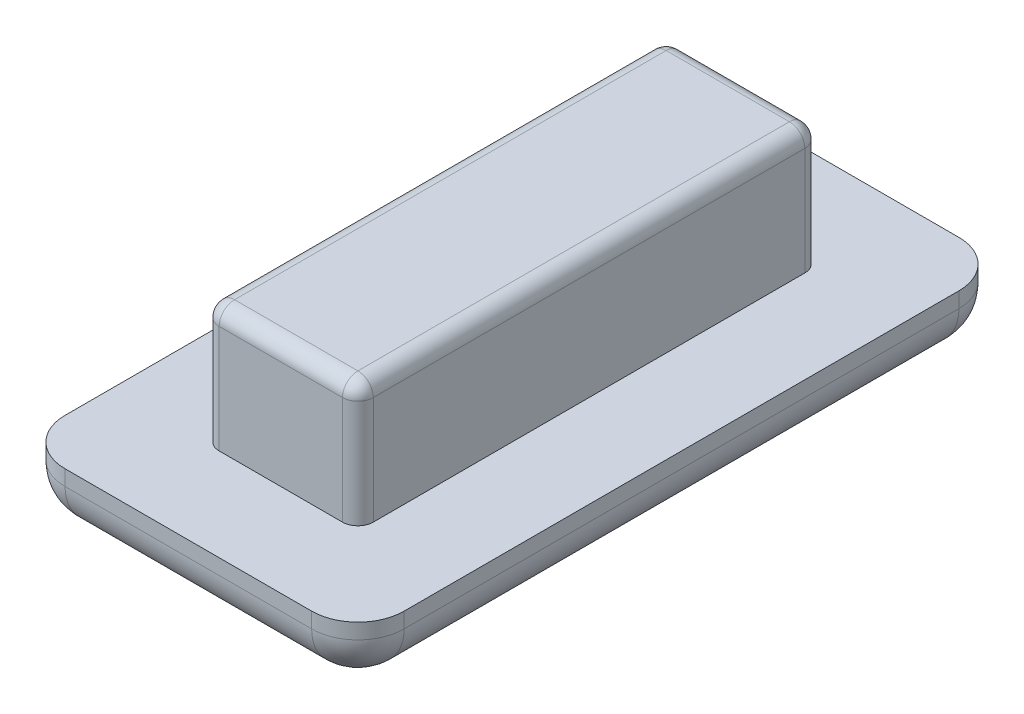
ISO-10303-21;
HEADER;
FILE_DESCRIPTION(('STEP AP214'),'2;1');
FILE_NAME('part.step','',(''),(''),'','','');
FILE_SCHEMA(('AUTOMOTIVE_DESIGN { 1 0 10303 214 1 1 1 1 }'));
ENDSEC;
DATA;
#1=APPLICATION_CONTEXT('core data for automotive mechanical design processes');
#2=APPLICATION_PROTOCOL_DEFINITION('international standard','automotive_design',2000,#1);
#3=PRODUCT_CONTEXT('',#1,'mechanical');
#4=PRODUCT('Part','Part','',(#3));
#5=PRODUCT_RELATED_PRODUCT_CATEGORY('part','',(#4));
#6=PRODUCT_DEFINITION_FORMATION('','',#4);
#7=PRODUCT_DEFINITION_CONTEXT('part definition',#1,'design');
#8=PRODUCT_DEFINITION('design','',#6,#7);
#9=PRODUCT_DEFINITION_SHAPE('','',#8);
#10=(LENGTH_UNIT() NAMED_UNIT(*) SI_UNIT(.MILLI.,.METRE.));
#11=(NAMED_UNIT(*) PLANE_ANGLE_UNIT() SI_UNIT($,.RADIAN.));
#12=(NAMED_UNIT(*) SI_UNIT($,.STERADIAN.) SOLID_ANGLE_UNIT());
#13=UNCERTAINTY_MEASURE_WITH_UNIT(LENGTH_MEASURE(1.E-05),#10,'distance_accuracy_value','');
#14=(GEOMETRIC_REPRESENTATION_CONTEXT(3) GLOBAL_UNCERTAINTY_ASSIGNED_CONTEXT((#13)) GLOBAL_UNIT_ASSIGNED_CONTEXT((#10,
#11,#12)) REPRESENTATION_CONTEXT('',''));
#15=CARTESIAN_POINT('',(0.,0.,0.));
#16=DIRECTION('',(0.,0.,1.));
#17=DIRECTION('',(1.,0.,0.));
#18=AXIS2_PLACEMENT_3D('',#15,#16,#17);
#19=CARTESIAN_POINT('',(0.500000000000003,4.,-0.499999999999978));
#20=DIRECTION('',(1.,0.,0.));
#21=DIRECTION('',(0.,0.,-1.));
#22=AXIS2_PLACEMENT_3D('',#19,#20,#21);
#23=PLANE('',#22);
#24=DIRECTION('',(0.,0.,1.));
#25=VECTOR('',#24,1.);
#26=CARTESIAN_POINT('',(0.500000000000003,3.5,-15.5));
#27=LINE('',#26,#25);
#28=CARTESIAN_POINT('',(0.500000000000003,3.5,-0.999999999999978));
#29=VERTEX_POINT('',#28);
#30=CARTESIAN_POINT('',(0.500000000000003,3.5,-15.));
#31=VERTEX_POINT('',#30);
#32=EDGE_CURVE('E230',#29,#31,#27,.F.);
#33=ORIENTED_EDGE('',*,*,#32,.T.);
#34=DIRECTION('',(0.,-1.,0.));
#35=VECTOR('',#34,1.);
#36=CARTESIAN_POINT('',(0.500000000000003,4.,-15.));
#37=LINE('',#36,#35);
#38=CARTESIAN_POINT('',(0.500000000000003,0.,-15.));
#39=VERTEX_POINT('',#38);
#40=EDGE_CURVE('E232',#31,#39,#37,.T.);
#41=ORIENTED_EDGE('',*,*,#40,.T.);
#42=DIRECTION('',(0.,0.,1.));
#43=VECTOR('',#42,1.);
#44=CARTESIAN_POINT('',(0.500000000000003,0.,-0.499999999999978));
#45=LINE('',#44,#43);
#46=CARTESIAN_POINT('',(0.500000000000003,0.,-0.999999999999978));
#47=VERTEX_POINT('',#46);
#48=EDGE_CURVE('E382',#39,#47,#45,.T.);
#49=ORIENTED_EDGE('',*,*,#48,.T.);
#50=DIRECTION('',(0.,-1.,0.));
#51=VECTOR('',#50,1.);
#52=CARTESIAN_POINT('',(0.500000000000003,4.,-0.999999999999978));
#53=LINE('',#52,#51);
#54=EDGE_CURVE('E228',#47,#29,#53,.F.);
#55=ORIENTED_EDGE('',*,*,#54,.T.);
#56=EDGE_LOOP('',(#33,#41,#49,#55));
#57=FACE_BOUND('',#56,.T.);
#58=ADVANCED_FACE('F33',(#57),#23,.F.);
#59=CARTESIAN_POINT('',(5.50000000000001,4.,-0.499999999999978));
#60=DIRECTION('',(0.,0.,-1.));
#61=DIRECTION('',(-1.,0.,0.));
#62=AXIS2_PLACEMENT_3D('',#59,#60,#61);
#63=PLANE('',#62);
#64=DIRECTION('',(1.,0.,0.));
#65=VECTOR('',#64,1.);
#66=CARTESIAN_POINT('',(0.500000000000003,3.5,-0.499999999999978));
#67=LINE('',#66,#65);
#68=CARTESIAN_POINT('',(5.00000000000001,3.5,-0.499999999999978));
#69=VERTEX_POINT('',#68);
#70=CARTESIAN_POINT('',(1.,3.5,-0.499999999999978));
#71=VERTEX_POINT('',#70);
#72=EDGE_CURVE('E224',#69,#71,#67,.F.);
#73=ORIENTED_EDGE('',*,*,#72,.T.);
#74=DIRECTION('',(0.,-1.,0.));
#75=VECTOR('',#74,1.);
#76=CARTESIAN_POINT('',(1.,4.,-0.499999999999978));
#77=LINE('',#76,#75);
#78=CARTESIAN_POINT('',(1.,0.,-0.499999999999978));
#79=VERTEX_POINT('',#78);
#80=EDGE_CURVE('E226',#71,#79,#77,.T.);
#81=ORIENTED_EDGE('',*,*,#80,.T.);
#82=DIRECTION('',(1.,0.,0.));
#83=VECTOR('',#82,1.);
#84=CARTESIAN_POINT('',(5.50000000000001,0.,-0.499999999999978));
#85=LINE('',#84,#83);
#86=CARTESIAN_POINT('',(5.00000000000001,0.,-0.499999999999978));
#87=VERTEX_POINT('',#86);
#88=EDGE_CURVE('E385',#79,#87,#85,.T.);
#89=ORIENTED_EDGE('',*,*,#88,.T.);
#90=DIRECTION('',(0.,-1.,0.));
#91=VECTOR('',#90,1.);
#92=CARTESIAN_POINT('',(5.00000000000001,4.,-0.499999999999978));
#93=LINE('',#92,#91);
#94=EDGE_CURVE('E222',#87,#69,#93,.F.);
#95=ORIENTED_EDGE('',*,*,#94,.T.);
#96=EDGE_LOOP('',(#73,#81,#89,#95));
#97=FACE_BOUND('',#96,.T.);
#98=ADVANCED_FACE('F442',(#97),#63,.F.);
#99=CARTESIAN_POINT('',(5.50000000000001,4.,-0.499999999999978));
#100=DIRECTION('',(-1.,0.,0.));
#101=DIRECTION('',(0.,0.,1.));
#102=AXIS2_PLACEMENT_3D('',#99,#100,#101);
#103=PLANE('',#102);
#104=DIRECTION('',(0.,0.,-1.));
#105=VECTOR('',#104,1.);
#106=CARTESIAN_POINT('',(5.50000000000001,0.,-0.499999999999978));
#107=LINE('',#106,#105);
#108=CARTESIAN_POINT('',(5.50000000000001,0.,-0.999999999999978));
#109=VERTEX_POINT('',#108);
#110=CARTESIAN_POINT('',(5.50000000000001,0.,-15.));
#111=VERTEX_POINT('',#110);
#112=EDGE_CURVE('E388',#109,#111,#107,.T.);
#113=ORIENTED_EDGE('',*,*,#112,.T.);
#114=DIRECTION('',(0.,-1.,0.));
#115=VECTOR('',#114,1.);
#116=CARTESIAN_POINT('',(5.50000000000001,4.,-15.));
#117=LINE('',#116,#115);
#118=CARTESIAN_POINT('',(5.50000000000001,3.5,-15.));
#119=VERTEX_POINT('',#118);
#120=EDGE_CURVE('E220',#111,#119,#117,.F.);
#121=ORIENTED_EDGE('',*,*,#120,.T.);
#122=DIRECTION('',(0.,0.,-1.));
#123=VECTOR('',#122,1.);
#124=CARTESIAN_POINT('',(5.50000000000001,3.5,-0.499999999999978));
#125=LINE('',#124,#123);
#126=CARTESIAN_POINT('',(5.50000000000001,3.5,-0.999999999999978));
#127=VERTEX_POINT('',#126);
#128=EDGE_CURVE('E218',#119,#127,#125,.F.);
#129=ORIENTED_EDGE('',*,*,#128,.T.);
#130=DIRECTION('',(0.,-1.,0.));
#131=VECTOR('',#130,1.);
#132=CARTESIAN_POINT('',(5.50000000000001,4.,-0.999999999999978));
#133=LINE('',#132,#131);
#134=EDGE_CURVE('E216',#127,#109,#133,.T.);
#135=ORIENTED_EDGE('',*,*,#134,.T.);
#136=EDGE_LOOP('',(#113,#121,#129,#135));
#137=FACE_BOUND('',#136,.T.);
#138=ADVANCED_FACE('F447',(#137),#103,.F.);
#139=CARTESIAN_POINT('',(5.50000000000001,4.,-15.5));
#140=DIRECTION('',(0.,0.,1.));
#141=DIRECTION('',(1.,0.,0.));
#142=AXIS2_PLACEMENT_3D('',#139,#140,#141);
#143=PLANE('',#142);
#144=DIRECTION('',(-1.,0.,0.));
#145=VECTOR('',#144,1.);
#146=CARTESIAN_POINT('',(5.50000000000001,0.,-15.5));
#147=LINE('',#146,#145);
#148=CARTESIAN_POINT('',(5.00000000000001,0.,-15.5));
#149=VERTEX_POINT('',#148);
#150=CARTESIAN_POINT('',(1.,0.,-15.5));
#151=VERTEX_POINT('',#150);
#152=EDGE_CURVE('E201',#149,#151,#147,.T.);
#153=ORIENTED_EDGE('',*,*,#152,.T.);
#154=DIRECTION('',(0.,-1.,0.));
#155=VECTOR('',#154,1.);
#156=CARTESIAN_POINT('',(1.,4.,-15.5));
#157=LINE('',#156,#155);
#158=CARTESIAN_POINT('',(1.,3.5,-15.5));
#159=VERTEX_POINT('',#158);
#160=EDGE_CURVE('E214',#151,#159,#157,.F.);
#161=ORIENTED_EDGE('',*,*,#160,.T.);
#162=DIRECTION('',(-1.,0.,0.));
#163=VECTOR('',#162,1.);
#164=CARTESIAN_POINT('',(5.50000000000001,3.5,-15.5));
#165=LINE('',#164,#163);
#166=CARTESIAN_POINT('',(5.00000000000001,3.5,-15.5));
#167=VERTEX_POINT('',#166);
#168=EDGE_CURVE('E178',#159,#167,#165,.F.);
#169=ORIENTED_EDGE('',*,*,#168,.T.);
#170=DIRECTION('',(0.,-1.,0.));
#171=VECTOR('',#170,1.);
#172=CARTESIAN_POINT('',(5.00000000000001,4.,-15.5));
#173=LINE('',#172,#171);
#174=EDGE_CURVE('E207',#167,#149,#173,.T.);
#175=ORIENTED_EDGE('',*,*,#174,.T.);
#176=EDGE_LOOP('',(#153,#161,#169,#175));
#177=FACE_BOUND('',#176,.T.);
#178=ADVANCED_FACE('F415',(#177),#143,.F.);
#179=CARTESIAN_POINT('',(0.,4.,0.));
#180=DIRECTION('',(0.,1.,0.));
#181=DIRECTION('',(0.,0.,1.));
#182=AXIS2_PLACEMENT_3D('',#179,#180,#181);
#183=PLANE('',#182);
#184=DIRECTION('',(0.,0.,-1.));
#185=VECTOR('',#184,1.);
#186=CARTESIAN_POINT('',(5.00000000000001,4.,-15.5));
#187=LINE('',#186,#185);
#188=CARTESIAN_POINT('',(5.00000000000001,4.,-0.999999999999978));
#189=VERTEX_POINT('',#188);
#190=CARTESIAN_POINT('',(5.00000000000001,4.,-15.));
#191=VERTEX_POINT('',#190);
#192=EDGE_CURVE('E205',#189,#191,#187,.T.);
#193=ORIENTED_EDGE('',*,*,#192,.T.);
#194=DIRECTION('',(-1.,0.,0.));
#195=VECTOR('',#194,1.);
#196=CARTESIAN_POINT('',(0.500000000000003,4.,-15.));
#197=LINE('',#196,#195);
#198=CARTESIAN_POINT('',(1.,4.,-15.));
#199=VERTEX_POINT('',#198);
#200=EDGE_CURVE('E176',#191,#199,#197,.T.);
#201=ORIENTED_EDGE('',*,*,#200,.T.);
#202=DIRECTION('',(0.,0.,1.));
#203=VECTOR('',#202,1.);
#204=CARTESIAN_POINT('',(1.,4.,-0.499999999999978));
#205=LINE('',#204,#203);
#206=CARTESIAN_POINT('',(1.,4.,-0.999999999999978));
#207=VERTEX_POINT('',#206);
#208=EDGE_CURVE('E194',#199,#207,#205,.T.);
#209=ORIENTED_EDGE('',*,*,#208,.T.);
#210=DIRECTION('',(1.,0.,0.));
#211=VECTOR('',#210,1.);
#212=CARTESIAN_POINT('',(5.50000000000001,4.,-0.999999999999978));
#213=LINE('',#212,#211);
#214=EDGE_CURVE('E200',#207,#189,#213,.T.);
#215=ORIENTED_EDGE('',*,*,#214,.T.);
#216=EDGE_LOOP('',(#193,#201,#209,#215));
#217=FACE_BOUND('',#216,.T.);
#218=ADVANCED_FACE('F203',(#217),#183,.T.);
#219=CARTESIAN_POINT('',(8.50000000000001,-2.,2.50000000000002));
#220=DIRECTION('',(-1.,0.,0.));
#221=DIRECTION('',(0.,0.,1.));
#222=AXIS2_PLACEMENT_3D('',#219,#220,#221);
#223=PLANE('',#222);
#224=DIRECTION('',(0.,0.,1.));
#225=VECTOR('',#224,1.);
#226=CARTESIAN_POINT('',(8.50000000000001,-0.5,-18.5));
#227=LINE('',#226,#225);
#228=CARTESIAN_POINT('',(8.50000000000001,-0.5,1.00000000000002));
#229=VERTEX_POINT('',#228);
#230=CARTESIAN_POINT('',(8.50000000000001,-0.5,-17.));
#231=VERTEX_POINT('',#230);
#232=EDGE_CURVE('E50',#229,#231,#227,.F.);
#233=ORIENTED_EDGE('',*,*,#232,.T.);
#234=DIRECTION('',(0.,1.,0.));
#235=VECTOR('',#234,1.);
#236=CARTESIAN_POINT('',(8.50000000000001,-2.,-17.));
#237=LINE('',#236,#235);
#238=CARTESIAN_POINT('',(8.50000000000001,0.,-17.));
#239=VERTEX_POINT('',#238);
#240=EDGE_CURVE('E296',#231,#239,#237,.T.);
#241=ORIENTED_EDGE('',*,*,#240,.T.);
#242=DIRECTION('',(0.,0.,1.));
#243=VECTOR('',#242,1.);
#244=CARTESIAN_POINT('',(8.50000000000001,0.,2.50000000000002));
#245=LINE('',#244,#243);
#246=CARTESIAN_POINT('',(8.50000000000001,0.,1.00000000000002));
#247=VERTEX_POINT('',#246);
#248=EDGE_CURVE('E266',#239,#247,#245,.T.);
#249=ORIENTED_EDGE('',*,*,#248,.T.);
#250=DIRECTION('',(0.,1.,0.));
#251=VECTOR('',#250,1.);
#252=CARTESIAN_POINT('',(8.50000000000001,-2.,1.00000000000002));
#253=LINE('',#252,#251);
#254=EDGE_CURVE('E55',#247,#229,#253,.F.);
#255=ORIENTED_EDGE('',*,*,#254,.T.);
#256=EDGE_LOOP('',(#233,#241,#249,#255));
#257=FACE_BOUND('',#256,.T.);
#258=ADVANCED_FACE('F372',(#257),#223,.F.);
#259=CARTESIAN_POINT('',(-2.5,-2.,2.50000000000002));
#260=DIRECTION('',(0.,0.,-1.));
#261=DIRECTION('',(-1.,0.,0.));
#262=AXIS2_PLACEMENT_3D('',#259,#260,#261);
#263=PLANE('',#262);
#264=DIRECTION('',(-1.,0.,0.));
#265=VECTOR('',#264,1.);
#266=CARTESIAN_POINT('',(-2.5,0.,2.50000000000002));
#267=LINE('',#266,#265);
#268=CARTESIAN_POINT('',(7.00000000000001,0.,2.50000000000002));
#269=VERTEX_POINT('',#268);
#270=CARTESIAN_POINT('',(-0.999999999999996,0.,2.50000000000002));
#271=VERTEX_POINT('',#270);
#272=EDGE_CURVE('E371',#269,#271,#267,.T.);
#273=ORIENTED_EDGE('',*,*,#272,.T.);
#274=DIRECTION('',(0.,1.,0.));
#275=VECTOR('',#274,1.);
#276=CARTESIAN_POINT('',(-0.999999999999996,-2.,2.50000000000002));
#277=LINE('',#276,#275);
#278=CARTESIAN_POINT('',(-0.999999999999996,-0.5,2.50000000000002));
#279=VERTEX_POINT('',#278);
#280=EDGE_CURVE('E292',#271,#279,#277,.F.);
#281=ORIENTED_EDGE('',*,*,#280,.T.);
#282=DIRECTION('',(-1.,0.,0.));
#283=VECTOR('',#282,1.);
#284=CARTESIAN_POINT('',(8.50000000000001,-0.5,2.50000000000002));
#285=LINE('',#284,#283);
#286=CARTESIAN_POINT('',(7.00000000000001,-0.5,2.50000000000002));
#287=VERTEX_POINT('',#286);
#288=EDGE_CURVE('E290',#279,#287,#285,.F.);
#289=ORIENTED_EDGE('',*,*,#288,.T.);
#290=DIRECTION('',(0.,1.,0.));
#291=VECTOR('',#290,1.);
#292=CARTESIAN_POINT('',(7.00000000000001,-2.,2.50000000000002));
#293=LINE('',#292,#291);
#294=EDGE_CURVE('E288',#287,#269,#293,.T.);
#295=ORIENTED_EDGE('',*,*,#294,.T.);
#296=EDGE_LOOP('',(#273,#281,#289,#295));
#297=FACE_BOUND('',#296,.T.);
#298=ADVANCED_FACE('F360',(#297),#263,.F.);
#299=CARTESIAN_POINT('',(-2.5,-2.,2.50000000000002));
#300=DIRECTION('',(1.,0.,0.));
#301=DIRECTION('',(0.,0.,-1.));
#302=AXIS2_PLACEMENT_3D('',#299,#300,#301);
#303=PLANE('',#302);
#304=DIRECTION('',(0.,0.,-1.));
#305=VECTOR('',#304,1.);
#306=CARTESIAN_POINT('',(-2.5,-0.5,2.50000000000002));
#307=LINE('',#306,#305);
#308=CARTESIAN_POINT('',(-2.5,-0.5,-17.));
#309=VERTEX_POINT('',#308);
#310=CARTESIAN_POINT('',(-2.5,-0.5,1.00000000000002));
#311=VERTEX_POINT('',#310);
#312=EDGE_CURVE('E284',#309,#311,#307,.F.);
#313=ORIENTED_EDGE('',*,*,#312,.T.);
#314=DIRECTION('',(0.,1.,0.));
#315=VECTOR('',#314,1.);
#316=CARTESIAN_POINT('',(-2.5,-2.,1.00000000000002));
#317=LINE('',#316,#315);
#318=CARTESIAN_POINT('',(-2.5,0.,1.00000000000002));
#319=VERTEX_POINT('',#318);
#320=EDGE_CURVE('E286',#311,#319,#317,.T.);
#321=ORIENTED_EDGE('',*,*,#320,.T.);
#322=DIRECTION('',(0.,0.,-1.));
#323=VECTOR('',#322,1.);
#324=CARTESIAN_POINT('',(-2.5,0.,2.50000000000002));
#325=LINE('',#324,#323);
#326=CARTESIAN_POINT('',(-2.5,0.,-17.));
#327=VERTEX_POINT('',#326);
#328=EDGE_CURVE('E374',#319,#327,#325,.T.);
#329=ORIENTED_EDGE('',*,*,#328,.T.);
#330=DIRECTION('',(0.,1.,0.));
#331=VECTOR('',#330,1.);
#332=CARTESIAN_POINT('',(-2.5,-2.,-17.));
#333=LINE('',#332,#331);
#334=EDGE_CURVE('E282',#327,#309,#333,.F.);
#335=ORIENTED_EDGE('',*,*,#334,.T.);
#336=EDGE_LOOP('',(#313,#321,#329,#335));
#337=FACE_BOUND('',#336,.T.);
#338=ADVANCED_FACE('F668',(#337),#303,.F.);
#339=CARTESIAN_POINT('',(-2.5,-2.,-18.5));
#340=DIRECTION('',(0.,0.,1.));
#341=DIRECTION('',(1.,0.,0.));
#342=AXIS2_PLACEMENT_3D('',#339,#340,#341);
#343=PLANE('',#342);
#344=DIRECTION('',(1.,0.,0.));
#345=VECTOR('',#344,1.);
#346=CARTESIAN_POINT('',(-2.5,-0.5,-18.5));
#347=LINE('',#346,#345);
#348=CARTESIAN_POINT('',(7.00000000000001,-0.5,-18.5));
#349=VERTEX_POINT('',#348);
#350=CARTESIAN_POINT('',(-0.999999999999996,-0.5,-18.5));
#351=VERTEX_POINT('',#350);
#352=EDGE_CURVE('E277',#349,#351,#347,.F.);
#353=ORIENTED_EDGE('',*,*,#352,.T.);
#354=DIRECTION('',(0.,1.,0.));
#355=VECTOR('',#354,1.);
#356=CARTESIAN_POINT('',(-0.999999999999996,-2.,-18.5));
#357=LINE('',#356,#355);
#358=CARTESIAN_POINT('',(-0.999999999999996,0.,-18.5));
#359=VERTEX_POINT('',#358);
#360=EDGE_CURVE('E280',#351,#359,#357,.T.);
#361=ORIENTED_EDGE('',*,*,#360,.T.);
#362=DIRECTION('',(1.,0.,0.));
#363=VECTOR('',#362,1.);
#364=CARTESIAN_POINT('',(-2.5,0.,-18.5));
#365=LINE('',#364,#363);
#366=CARTESIAN_POINT('',(7.00000000000001,0.,-18.5));
#367=VERTEX_POINT('',#366);
#368=EDGE_CURVE('E379',#359,#367,#365,.T.);
#369=ORIENTED_EDGE('',*,*,#368,.T.);
#370=DIRECTION('',(0.,1.,0.));
#371=VECTOR('',#370,1.);
#372=CARTESIAN_POINT('',(7.00000000000001,-2.,-18.5));
#373=LINE('',#372,#371);
#374=EDGE_CURVE('E275',#367,#349,#373,.F.);
#375=ORIENTED_EDGE('',*,*,#374,.T.);
#376=EDGE_LOOP('',(#353,#361,#369,#375));
#377=FACE_BOUND('',#376,.T.);
#378=ADVANCED_FACE('F660',(#377),#343,.F.);
#379=CARTESIAN_POINT('',(0.,-2.,0.));
#380=DIRECTION('',(0.,-1.,0.));
#381=DIRECTION('',(0.,0.,-1.));
#382=AXIS2_PLACEMENT_3D('',#379,#380,#381);
#383=PLANE('',#382);
#384=DIRECTION('',(0.,0.,-1.));
#385=VECTOR('',#384,1.);
#386=CARTESIAN_POINT('',(-0.999999999999996,-2.,-18.5));
#387=LINE('',#386,#385);
#388=CARTESIAN_POINT('',(-0.999999999999996,-2.,1.00000000000002));
#389=VERTEX_POINT('',#388);
#390=CARTESIAN_POINT('',(-0.999999999999996,-2.,-17.));
#391=VERTEX_POINT('',#390);
#392=EDGE_CURVE('E270',#389,#391,#387,.T.);
#393=ORIENTED_EDGE('',*,*,#392,.T.);
#394=DIRECTION('',(1.,0.,0.));
#395=VECTOR('',#394,1.);
#396=CARTESIAN_POINT('',(8.50000000000001,-2.,-17.));
#397=LINE('',#396,#395);
#398=CARTESIAN_POINT('',(7.00000000000001,-2.,-17.));
#399=VERTEX_POINT('',#398);
#400=EDGE_CURVE('E272',#391,#399,#397,.T.);
#401=ORIENTED_EDGE('',*,*,#400,.T.);
#402=DIRECTION('',(0.,0.,1.));
#403=VECTOR('',#402,1.);
#404=CARTESIAN_POINT('',(7.00000000000001,-2.,2.50000000000002));
#405=LINE('',#404,#403);
#406=CARTESIAN_POINT('',(7.00000000000001,-2.,1.00000000000002));
#407=VERTEX_POINT('',#406);
#408=EDGE_CURVE('E241',#399,#407,#405,.T.);
#409=ORIENTED_EDGE('',*,*,#408,.T.);
#410=DIRECTION('',(-1.,0.,0.));
#411=VECTOR('',#410,1.);
#412=CARTESIAN_POINT('',(-2.5,-2.,1.00000000000002));
#413=LINE('',#412,#411);
#414=EDGE_CURVE('E268',#407,#389,#413,.T.);
#415=ORIENTED_EDGE('',*,*,#414,.T.);
#416=EDGE_LOOP('',(#393,#401,#409,#415));
#417=FACE_BOUND('',#416,.T.);
#418=ADVANCED_FACE('F349',(#417),#383,.T.);
#419=CARTESIAN_POINT('',(0.,0.,0.));
#420=DIRECTION('',(0.,-1.,0.));
#421=DIRECTION('',(0.,0.,-1.));
#422=AXIS2_PLACEMENT_3D('',#419,#420,#421);
#423=PLANE('',#422);
#424=ORIENTED_EDGE('',*,*,#48,.F.);
#425=CARTESIAN_POINT('',(1.,0.,-15.));
#426=DIRECTION('',(0.,-1.,0.));
#427=DIRECTION('',(0.,0.,-1.));
#428=AXIS2_PLACEMENT_3D('',#425,#426,#427);
#429=CIRCLE('',#428,0.5);
#430=EDGE_CURVE('E234',#39,#151,#429,.T.);
#431=ORIENTED_EDGE('',*,*,#430,.T.);
#432=ORIENTED_EDGE('',*,*,#152,.F.);
#433=CARTESIAN_POINT('',(5.00000000000001,0.,-15.));
#434=DIRECTION('',(0.,-1.,0.));
#435=DIRECTION('',(0.,0.,-1.));
#436=AXIS2_PLACEMENT_3D('',#433,#434,#435);
#437=CIRCLE('',#436,0.5);
#438=EDGE_CURVE('E236',#149,#111,#437,.T.);
#439=ORIENTED_EDGE('',*,*,#438,.T.);
#440=ORIENTED_EDGE('',*,*,#112,.F.);
#441=CARTESIAN_POINT('',(5.00000000000001,0.,-0.999999999999978));
#442=DIRECTION('',(0.,-1.,0.));
#443=DIRECTION('',(0.,0.,-1.));
#444=AXIS2_PLACEMENT_3D('',#441,#442,#443);
#445=CIRCLE('',#444,0.5);
#446=EDGE_CURVE('E240',#109,#87,#445,.T.);
#447=ORIENTED_EDGE('',*,*,#446,.T.);
#448=ORIENTED_EDGE('',*,*,#88,.F.);
#449=CARTESIAN_POINT('',(1.,0.,-0.999999999999978));
#450=DIRECTION('',(0.,-1.,0.));
#451=DIRECTION('',(0.,0.,-1.));
#452=AXIS2_PLACEMENT_3D('',#449,#450,#451);
#453=CIRCLE('',#452,0.5);
#454=EDGE_CURVE('E238',#79,#47,#453,.T.);
#455=ORIENTED_EDGE('',*,*,#454,.T.);
#456=EDGE_LOOP('',(#424,#431,#432,#439,#440,#447,#448,#455));
#457=FACE_BOUND('',#456,.T.);
#458=ORIENTED_EDGE('',*,*,#328,.F.);
#459=CARTESIAN_POINT('',(-0.999999999999996,0.,1.00000000000002));
#460=DIRECTION('',(0.,-1.,0.));
#461=DIRECTION('',(0.,0.,-1.));
#462=AXIS2_PLACEMENT_3D('',#459,#460,#461);
#463=CIRCLE('',#462,1.5);
#464=EDGE_CURVE('E11',#319,#271,#463,.F.);
#465=ORIENTED_EDGE('',*,*,#464,.T.);
#466=ORIENTED_EDGE('',*,*,#272,.F.);
#467=CARTESIAN_POINT('',(7.00000000000001,0.,1.00000000000002));
#468=DIRECTION('',(0.,-1.,0.));
#469=DIRECTION('',(0.,0.,-1.));
#470=AXIS2_PLACEMENT_3D('',#467,#468,#469);
#471=CIRCLE('',#470,1.5);
#472=EDGE_CURVE('E298',#269,#247,#471,.F.);
#473=ORIENTED_EDGE('',*,*,#472,.T.);
#474=ORIENTED_EDGE('',*,*,#248,.F.);
#475=CARTESIAN_POINT('',(7.00000000000001,0.,-17.));
#476=DIRECTION('',(0.,-1.,0.));
#477=DIRECTION('',(0.,0.,-1.));
#478=AXIS2_PLACEMENT_3D('',#475,#476,#477);
#479=CIRCLE('',#478,1.5);
#480=EDGE_CURVE('E300',#239,#367,#479,.F.);
#481=ORIENTED_EDGE('',*,*,#480,.T.);
#482=ORIENTED_EDGE('',*,*,#368,.F.);
#483=CARTESIAN_POINT('',(-0.999999999999996,0.,-17.));
#484=DIRECTION('',(0.,-1.,0.));
#485=DIRECTION('',(0.,0.,-1.));
#486=AXIS2_PLACEMENT_3D('',#483,#484,#485);
#487=CIRCLE('',#486,1.5);
#488=EDGE_CURVE('E42',#359,#327,#487,.F.);
#489=ORIENTED_EDGE('',*,*,#488,.T.);
#490=EDGE_LOOP('',(#458,#465,#466,#473,#474,#481,#482,#489));
#491=FACE_BOUND('',#490,.T.);
#492=ADVANCED_FACE('F369',(#457,#491),#423,.F.);
#493=CARTESIAN_POINT('',(5.00000000000001,4.,-0.999999999999978));
#494=DIRECTION('',(0.,-1.,0.));
#495=DIRECTION('',(0.,0.,-1.));
#496=AXIS2_PLACEMENT_3D('',#493,#494,#495);
#497=CYLINDRICAL_SURFACE('',#496,0.5);
#498=ORIENTED_EDGE('',*,*,#446,.F.);
#499=ORIENTED_EDGE('',*,*,#134,.F.);
#500=CARTESIAN_POINT('',(5.00000000000001,3.5,-0.999999999999978));
#501=DIRECTION('',(0.,1.,0.));
#502=DIRECTION('',(0.,0.,1.));
#503=AXIS2_PLACEMENT_3D('',#500,#501,#502);
#504=CIRCLE('',#503,0.5);
#505=EDGE_CURVE('E263',#69,#127,#504,.T.);
#506=ORIENTED_EDGE('',*,*,#505,.F.);
#507=ORIENTED_EDGE('',*,*,#94,.F.);
#508=EDGE_LOOP('',(#498,#499,#506,#507));
#509=FACE_BOUND('',#508,.T.);
#510=ADVANCED_FACE('F637',(#509),#497,.T.);
#511=CARTESIAN_POINT('',(0.,3.5,-0.999999999999978));
#512=DIRECTION('',(-1.,0.,0.));
#513=DIRECTION('',(0.,0.,1.));
#514=AXIS2_PLACEMENT_3D('',#511,#512,#513);
#515=CYLINDRICAL_SURFACE('',#514,0.5);
#516=CARTESIAN_POINT('',(1.,3.5,-0.999999999999978));
#517=DIRECTION('',(-1.,0.,0.));
#518=DIRECTION('',(0.,-1.,0.));
#519=AXIS2_PLACEMENT_3D('',#516,#517,#518);
#520=CIRCLE('',#519,0.5);
#521=EDGE_CURVE('E257',#71,#207,#520,.T.);
#522=ORIENTED_EDGE('',*,*,#521,.F.);
#523=ORIENTED_EDGE('',*,*,#72,.F.);
#524=CARTESIAN_POINT('',(5.00000000000001,3.5,-0.999999999999978));
#525=DIRECTION('',(1.,0.,0.));
#526=DIRECTION('',(0.,0.,-1.));
#527=AXIS2_PLACEMENT_3D('',#524,#525,#526);
#528=CIRCLE('',#527,0.5);
#529=EDGE_CURVE('E260',#189,#69,#528,.T.);
#530=ORIENTED_EDGE('',*,*,#529,.F.);
#531=ORIENTED_EDGE('',*,*,#214,.F.);
#532=EDGE_LOOP('',(#522,#523,#530,#531));
#533=FACE_BOUND('',#532,.T.);
#534=ADVANCED_FACE('F397',(#533),#515,.T.);
#535=CARTESIAN_POINT('',(1.,4.,-0.999999999999978));
#536=DIRECTION('',(0.,-1.,0.));
#537=DIRECTION('',(0.,0.,-1.));
#538=AXIS2_PLACEMENT_3D('',#535,#536,#537);
#539=CYLINDRICAL_SURFACE('',#538,0.5);
#540=ORIENTED_EDGE('',*,*,#454,.F.);
#541=ORIENTED_EDGE('',*,*,#80,.F.);
#542=CARTESIAN_POINT('',(1.,3.5,-0.999999999999978));
#543=DIRECTION('',(0.,1.,0.));
#544=DIRECTION('',(0.,0.,1.));
#545=AXIS2_PLACEMENT_3D('',#542,#543,#544);
#546=CIRCLE('',#545,0.5);
#547=EDGE_CURVE('E254',#29,#71,#546,.T.);
#548=ORIENTED_EDGE('',*,*,#547,.F.);
#549=ORIENTED_EDGE('',*,*,#54,.F.);
#550=EDGE_LOOP('',(#540,#541,#548,#549));
#551=FACE_BOUND('',#550,.T.);
#552=ADVANCED_FACE('F429',(#551),#539,.T.);
#553=CARTESIAN_POINT('',(5.00000000000001,3.5,-0.999999999999978));
#554=DIRECTION('',(0.,0.,1.));
#555=DIRECTION('',(1.,0.,0.));
#556=AXIS2_PLACEMENT_3D('',#553,#554,#555);
#557=SPHERICAL_SURFACE('',#556,0.5);
#558=ORIENTED_EDGE('',*,*,#529,.T.);
#559=ORIENTED_EDGE('',*,*,#505,.T.);
#560=CARTESIAN_POINT('',(5.00000000000001,3.5,-0.999999999999978));
#561=DIRECTION('',(0.,0.,1.));
#562=DIRECTION('',(1.,0.,0.));
#563=AXIS2_PLACEMENT_3D('',#560,#561,#562);
#564=CIRCLE('',#563,0.5);
#565=EDGE_CURVE('E251',#189,#127,#564,.F.);
#566=ORIENTED_EDGE('',*,*,#565,.F.);
#567=EDGE_LOOP('',(#558,#559,#566));
#568=FACE_BOUND('',#567,.T.);
#569=ADVANCED_FACE('F400',(#568),#557,.T.);
#570=CARTESIAN_POINT('',(1.,3.5,-0.999999999999978));
#571=DIRECTION('',(0.,0.,1.));
#572=DIRECTION('',(1.,0.,0.));
#573=AXIS2_PLACEMENT_3D('',#570,#571,#572);
#574=SPHERICAL_SURFACE('',#573,0.5);
#575=ORIENTED_EDGE('',*,*,#547,.T.);
#576=ORIENTED_EDGE('',*,*,#521,.T.);
#577=CARTESIAN_POINT('',(1.,3.5,-0.999999999999978));
#578=DIRECTION('',(0.,0.,1.));
#579=DIRECTION('',(1.,0.,0.));
#580=AXIS2_PLACEMENT_3D('',#577,#578,#579);
#581=CIRCLE('',#580,0.5);
#582=EDGE_CURVE('E197',#29,#207,#581,.F.);
#583=ORIENTED_EDGE('',*,*,#582,.F.);
#584=EDGE_LOOP('',(#575,#576,#583));
#585=FACE_BOUND('',#584,.T.);
#586=ADVANCED_FACE('F432',(#585),#574,.T.);
#587=CARTESIAN_POINT('',(5.00000000000001,4.,-15.));
#588=DIRECTION('',(0.,-1.,0.));
#589=DIRECTION('',(0.,0.,-1.));
#590=AXIS2_PLACEMENT_3D('',#587,#588,#589);
#591=CYLINDRICAL_SURFACE('',#590,0.5);
#592=ORIENTED_EDGE('',*,*,#438,.F.);
#593=ORIENTED_EDGE('',*,*,#174,.F.);
#594=CARTESIAN_POINT('',(5.00000000000001,3.5,-15.));
#595=DIRECTION('',(0.,1.,0.));
#596=DIRECTION('',(0.,0.,1.));
#597=AXIS2_PLACEMENT_3D('',#594,#595,#596);
#598=CIRCLE('',#597,0.5);
#599=EDGE_CURVE('E247',#119,#167,#598,.T.);
#600=ORIENTED_EDGE('',*,*,#599,.F.);
#601=ORIENTED_EDGE('',*,*,#120,.F.);
#602=EDGE_LOOP('',(#592,#593,#600,#601));
#603=FACE_BOUND('',#602,.T.);
#604=ADVANCED_FACE('F412',(#603),#591,.T.);
#605=CARTESIAN_POINT('',(5.00000000000001,3.5,0.));
#606=DIRECTION('',(0.,0.,1.));
#607=DIRECTION('',(1.,0.,0.));
#608=AXIS2_PLACEMENT_3D('',#605,#606,#607);
#609=CYLINDRICAL_SURFACE('',#608,0.5);
#610=ORIENTED_EDGE('',*,*,#565,.T.);
#611=ORIENTED_EDGE('',*,*,#128,.F.);
#612=CARTESIAN_POINT('',(5.00000000000001,3.5,-15.));
#613=DIRECTION('',(0.,0.,-1.));
#614=DIRECTION('',(-1.,0.,0.));
#615=AXIS2_PLACEMENT_3D('',#612,#613,#614);
#616=CIRCLE('',#615,0.5);
#617=EDGE_CURVE('E191',#191,#119,#616,.T.);
#618=ORIENTED_EDGE('',*,*,#617,.F.);
#619=ORIENTED_EDGE('',*,*,#192,.F.);
#620=EDGE_LOOP('',(#610,#611,#618,#619));
#621=FACE_BOUND('',#620,.T.);
#622=ADVANCED_FACE('F403',(#621),#609,.T.);
#623=CARTESIAN_POINT('',(1.,3.5,0.));
#624=DIRECTION('',(0.,0.,-1.));
#625=DIRECTION('',(-1.,0.,0.));
#626=AXIS2_PLACEMENT_3D('',#623,#624,#625);
#627=CYLINDRICAL_SURFACE('',#626,0.5);
#628=ORIENTED_EDGE('',*,*,#582,.T.);
#629=ORIENTED_EDGE('',*,*,#208,.F.);
#630=CARTESIAN_POINT('',(1.,3.5,-15.));
#631=DIRECTION('',(0.,0.,-1.));
#632=DIRECTION('',(-1.,0.,0.));
#633=AXIS2_PLACEMENT_3D('',#630,#631,#632);
#634=CIRCLE('',#633,0.5);
#635=EDGE_CURVE('E184',#31,#199,#634,.T.);
#636=ORIENTED_EDGE('',*,*,#635,.F.);
#637=ORIENTED_EDGE('',*,*,#32,.F.);
#638=EDGE_LOOP('',(#628,#629,#636,#637));
#639=FACE_BOUND('',#638,.T.);
#640=ADVANCED_FACE('F195',(#639),#627,.T.);
#641=CARTESIAN_POINT('',(1.,4.,-15.));
#642=DIRECTION('',(0.,-1.,0.));
#643=DIRECTION('',(0.,0.,-1.));
#644=AXIS2_PLACEMENT_3D('',#641,#642,#643);
#645=CYLINDRICAL_SURFACE('',#644,0.5);
#646=ORIENTED_EDGE('',*,*,#430,.F.);
#647=ORIENTED_EDGE('',*,*,#40,.F.);
#648=CARTESIAN_POINT('',(1.,3.5,-15.));
#649=DIRECTION('',(0.,1.,0.));
#650=DIRECTION('',(0.,0.,1.));
#651=AXIS2_PLACEMENT_3D('',#648,#649,#650);
#652=CIRCLE('',#651,0.5);
#653=EDGE_CURVE('E188',#159,#31,#652,.T.);
#654=ORIENTED_EDGE('',*,*,#653,.F.);
#655=ORIENTED_EDGE('',*,*,#160,.F.);
#656=EDGE_LOOP('',(#646,#647,#654,#655));
#657=FACE_BOUND('',#656,.T.);
#658=ADVANCED_FACE('F420',(#657),#645,.T.);
#659=CARTESIAN_POINT('',(5.00000000000001,3.5,-15.));
#660=DIRECTION('',(1.,0.,0.));
#661=DIRECTION('',(0.,0.,-1.));
#662=AXIS2_PLACEMENT_3D('',#659,#660,#661);
#663=SPHERICAL_SURFACE('',#662,0.5);
#664=ORIENTED_EDGE('',*,*,#617,.T.);
#665=ORIENTED_EDGE('',*,*,#599,.T.);
#666=CARTESIAN_POINT('',(5.00000000000001,3.5,-15.));
#667=DIRECTION('',(1.,0.,0.));
#668=DIRECTION('',(0.,0.,-1.));
#669=AXIS2_PLACEMENT_3D('',#666,#667,#668);
#670=CIRCLE('',#669,0.5);
#671=EDGE_CURVE('E181',#191,#167,#670,.F.);
#672=ORIENTED_EDGE('',*,*,#671,.F.);
#673=EDGE_LOOP('',(#664,#665,#672));
#674=FACE_BOUND('',#673,.T.);
#675=ADVANCED_FACE('F407',(#674),#663,.T.);
#676=CARTESIAN_POINT('',(1.,3.5,-15.));
#677=DIRECTION('',(-1.,0.,0.));
#678=DIRECTION('',(0.,0.,1.));
#679=AXIS2_PLACEMENT_3D('',#676,#677,#678);
#680=SPHERICAL_SURFACE('',#679,0.5);
#681=ORIENTED_EDGE('',*,*,#653,.T.);
#682=ORIENTED_EDGE('',*,*,#635,.T.);
#683=CARTESIAN_POINT('',(1.,3.5,-15.));
#684=DIRECTION('',(-1.,0.,0.));
#685=DIRECTION('',(0.,0.,1.));
#686=AXIS2_PLACEMENT_3D('',#683,#684,#685);
#687=CIRCLE('',#686,0.5);
#688=EDGE_CURVE('E172',#159,#199,#687,.F.);
#689=ORIENTED_EDGE('',*,*,#688,.F.);
#690=EDGE_LOOP('',(#681,#682,#689));
#691=FACE_BOUND('',#690,.T.);
#692=ADVANCED_FACE('F186',(#691),#680,.T.);
#693=CARTESIAN_POINT('',(0.,3.5,-15.));
#694=DIRECTION('',(1.,0.,0.));
#695=DIRECTION('',(0.,0.,-1.));
#696=AXIS2_PLACEMENT_3D('',#693,#694,#695);
#697=CYLINDRICAL_SURFACE('',#696,0.5);
#698=ORIENTED_EDGE('',*,*,#671,.T.);
#699=ORIENTED_EDGE('',*,*,#168,.F.);
#700=ORIENTED_EDGE('',*,*,#688,.T.);
#701=ORIENTED_EDGE('',*,*,#200,.F.);
#702=EDGE_LOOP('',(#698,#699,#700,#701));
#703=FACE_BOUND('',#702,.T.);
#704=ADVANCED_FACE('F174',(#703),#697,.T.);
#705=CARTESIAN_POINT('',(-0.999999999999996,-2.,1.00000000000002));
#706=DIRECTION('',(0.,1.,0.));
#707=DIRECTION('',(0.,0.,1.));
#708=AXIS2_PLACEMENT_3D('',#705,#706,#707);
#709=CYLINDRICAL_SURFACE('',#708,1.5);
#710=ORIENTED_EDGE('',*,*,#464,.F.);
#711=ORIENTED_EDGE('',*,*,#320,.F.);
#712=CARTESIAN_POINT('',(-0.999999999999996,-0.5,1.00000000000002));
#713=DIRECTION('',(0.,-1.,0.));
#714=DIRECTION('',(0.,0.,-1.));
#715=AXIS2_PLACEMENT_3D('',#712,#713,#714);
#716=CIRCLE('',#715,1.5);
#717=EDGE_CURVE('E37',#279,#311,#716,.T.);
#718=ORIENTED_EDGE('',*,*,#717,.F.);
#719=ORIENTED_EDGE('',*,*,#280,.F.);
#720=EDGE_LOOP('',(#710,#711,#718,#719));
#721=FACE_BOUND('',#720,.T.);
#722=ADVANCED_FACE('F35',(#721),#709,.T.);
#723=CARTESIAN_POINT('',(0.,-0.5,1.00000000000002));
#724=DIRECTION('',(1.,0.,0.));
#725=DIRECTION('',(0.,0.,-1.));
#726=AXIS2_PLACEMENT_3D('',#723,#724,#725);
#727=CYLINDRICAL_SURFACE('',#726,1.5);
#728=CARTESIAN_POINT('',(7.00000000000001,-0.5,1.00000000000002));
#729=DIRECTION('',(1.,0.,0.));
#730=DIRECTION('',(0.,1.,0.));
#731=AXIS2_PLACEMENT_3D('',#728,#729,#730);
#732=CIRCLE('',#731,1.5);
#733=EDGE_CURVE('E328',#287,#407,#732,.T.);
#734=ORIENTED_EDGE('',*,*,#733,.F.);
#735=ORIENTED_EDGE('',*,*,#288,.F.);
#736=CARTESIAN_POINT('',(-0.999999999999996,-0.5,1.00000000000002));
#737=DIRECTION('',(-1.,0.,0.));
#738=DIRECTION('',(0.,0.,1.));
#739=AXIS2_PLACEMENT_3D('',#736,#737,#738);
#740=CIRCLE('',#739,1.5);
#741=EDGE_CURVE('E330',#389,#279,#740,.T.);
#742=ORIENTED_EDGE('',*,*,#741,.F.);
#743=ORIENTED_EDGE('',*,*,#414,.F.);
#744=EDGE_LOOP('',(#734,#735,#742,#743));
#745=FACE_BOUND('',#744,.T.);
#746=ADVANCED_FACE('F356',(#745),#727,.T.);
#747=CARTESIAN_POINT('',(7.00000000000001,-2.,1.00000000000002));
#748=DIRECTION('',(0.,1.,0.));
#749=DIRECTION('',(0.,0.,1.));
#750=AXIS2_PLACEMENT_3D('',#747,#748,#749);
#751=CYLINDRICAL_SURFACE('',#750,1.5);
#752=ORIENTED_EDGE('',*,*,#472,.F.);
#753=ORIENTED_EDGE('',*,*,#294,.F.);
#754=CARTESIAN_POINT('',(7.00000000000001,-0.5,1.00000000000002));
#755=DIRECTION('',(0.,-1.,0.));
#756=DIRECTION('',(0.,0.,-1.));
#757=AXIS2_PLACEMENT_3D('',#754,#755,#756);
#758=CIRCLE('',#757,1.5);
#759=EDGE_CURVE('E325',#229,#287,#758,.T.);
#760=ORIENTED_EDGE('',*,*,#759,.F.);
#761=ORIENTED_EDGE('',*,*,#254,.F.);
#762=EDGE_LOOP('',(#752,#753,#760,#761));
#763=FACE_BOUND('',#762,.T.);
#764=ADVANCED_FACE('F364',(#763),#751,.T.);
#765=CARTESIAN_POINT('',(-0.999999999999996,-0.5,1.00000000000002));
#766=DIRECTION('',(0.,0.,1.));
#767=DIRECTION('',(1.,0.,0.));
#768=AXIS2_PLACEMENT_3D('',#765,#766,#767);
#769=SPHERICAL_SURFACE('',#768,1.5);
#770=ORIENTED_EDGE('',*,*,#741,.T.);
#771=ORIENTED_EDGE('',*,*,#717,.T.);
#772=CARTESIAN_POINT('',(-0.999999999999996,-0.5,1.00000000000002));
#773=DIRECTION('',(0.,0.,1.));
#774=DIRECTION('',(1.,0.,0.));
#775=AXIS2_PLACEMENT_3D('',#772,#773,#774);
#776=CIRCLE('',#775,1.5);
#777=EDGE_CURVE('E322',#389,#311,#776,.F.);
#778=ORIENTED_EDGE('',*,*,#777,.F.);
#779=EDGE_LOOP('',(#770,#771,#778));
#780=FACE_BOUND('',#779,.T.);
#781=ADVANCED_FACE('F337',(#780),#769,.T.);
#782=CARTESIAN_POINT('',(7.00000000000001,-0.5,1.00000000000002));
#783=DIRECTION('',(0.,0.,1.));
#784=DIRECTION('',(1.,0.,0.));
#785=AXIS2_PLACEMENT_3D('',#782,#783,#784);
#786=SPHERICAL_SURFACE('',#785,1.5);
#787=ORIENTED_EDGE('',*,*,#759,.T.);
#788=ORIENTED_EDGE('',*,*,#733,.T.);
#789=CARTESIAN_POINT('',(7.00000000000001,-0.5,1.00000000000002));
#790=DIRECTION('',(0.,0.,1.));
#791=DIRECTION('',(1.,0.,0.));
#792=AXIS2_PLACEMENT_3D('',#789,#790,#791);
#793=CIRCLE('',#792,1.5);
#794=EDGE_CURVE('E319',#229,#407,#793,.F.);
#795=ORIENTED_EDGE('',*,*,#794,.F.);
#796=EDGE_LOOP('',(#787,#788,#795));
#797=FACE_BOUND('',#796,.T.);
#798=ADVANCED_FACE('F511',(#797),#786,.T.);
#799=CARTESIAN_POINT('',(-0.999999999999996,-2.,-17.));
#800=DIRECTION('',(0.,1.,0.));
#801=DIRECTION('',(0.,0.,1.));
#802=AXIS2_PLACEMENT_3D('',#799,#800,#801);
#803=CYLINDRICAL_SURFACE('',#802,1.5);
#804=ORIENTED_EDGE('',*,*,#488,.F.);
#805=ORIENTED_EDGE('',*,*,#360,.F.);
#806=CARTESIAN_POINT('',(-0.999999999999996,-0.5,-17.));
#807=DIRECTION('',(0.,-1.,0.));
#808=DIRECTION('',(0.,0.,-1.));
#809=AXIS2_PLACEMENT_3D('',#806,#807,#808);
#810=CIRCLE('',#809,1.5);
#811=EDGE_CURVE('E316',#309,#351,#810,.T.);
#812=ORIENTED_EDGE('',*,*,#811,.F.);
#813=ORIENTED_EDGE('',*,*,#334,.F.);
#814=EDGE_LOOP('',(#804,#805,#812,#813));
#815=FACE_BOUND('',#814,.T.);
#816=ADVANCED_FACE('F518',(#815),#803,.T.);
#817=CARTESIAN_POINT('',(-0.999999999999996,-0.5,0.));
#818=DIRECTION('',(0.,0.,1.));
#819=DIRECTION('',(1.,0.,0.));
#820=AXIS2_PLACEMENT_3D('',#817,#818,#819);
#821=CYLINDRICAL_SURFACE('',#820,1.5);
#822=ORIENTED_EDGE('',*,*,#777,.T.);
#823=ORIENTED_EDGE('',*,*,#312,.F.);
#824=CARTESIAN_POINT('',(-0.999999999999996,-0.5,-17.));
#825=DIRECTION('',(0.,0.,-1.));
#826=DIRECTION('',(-1.,0.,0.));
#827=AXIS2_PLACEMENT_3D('',#824,#825,#826);
#828=CIRCLE('',#827,1.5);
#829=EDGE_CURVE('E313',#391,#309,#828,.T.);
#830=ORIENTED_EDGE('',*,*,#829,.F.);
#831=ORIENTED_EDGE('',*,*,#392,.F.);
#832=EDGE_LOOP('',(#822,#823,#830,#831));
#833=FACE_BOUND('',#832,.T.);
#834=ADVANCED_FACE('F344',(#833),#821,.T.);
#835=CARTESIAN_POINT('',(7.00000000000001,-0.5,0.));
#836=DIRECTION('',(0.,0.,-1.));
#837=DIRECTION('',(-1.,0.,0.));
#838=AXIS2_PLACEMENT_3D('',#835,#836,#837);
#839=CYLINDRICAL_SURFACE('',#838,1.5);
#840=ORIENTED_EDGE('',*,*,#794,.T.);
#841=ORIENTED_EDGE('',*,*,#408,.F.);
#842=CARTESIAN_POINT('',(7.00000000000001,-0.5,-17.));
#843=DIRECTION('',(0.,0.,-1.));
#844=DIRECTION('',(-1.,0.,0.));
#845=AXIS2_PLACEMENT_3D('',#842,#843,#844);
#846=CIRCLE('',#845,1.5);
#847=EDGE_CURVE('E310',#231,#399,#846,.T.);
#848=ORIENTED_EDGE('',*,*,#847,.F.);
#849=ORIENTED_EDGE('',*,*,#232,.F.);
#850=EDGE_LOOP('',(#840,#841,#848,#849));
#851=FACE_BOUND('',#850,.T.);
#852=ADVANCED_FACE('F533',(#851),#839,.T.);
#853=CARTESIAN_POINT('',(7.00000000000001,-2.,-17.));
#854=DIRECTION('',(0.,1.,0.));
#855=DIRECTION('',(0.,0.,1.));
#856=AXIS2_PLACEMENT_3D('',#853,#854,#855);
#857=CYLINDRICAL_SURFACE('',#856,1.5);
#858=ORIENTED_EDGE('',*,*,#480,.F.);
#859=ORIENTED_EDGE('',*,*,#240,.F.);
#860=CARTESIAN_POINT('',(7.00000000000001,-0.5,-17.));
#861=DIRECTION('',(0.,-1.,0.));
#862=DIRECTION('',(0.,0.,-1.));
#863=AXIS2_PLACEMENT_3D('',#860,#861,#862);
#864=CIRCLE('',#863,1.5);
#865=EDGE_CURVE('E307',#349,#231,#864,.T.);
#866=ORIENTED_EDGE('',*,*,#865,.F.);
#867=ORIENTED_EDGE('',*,*,#374,.F.);
#868=EDGE_LOOP('',(#858,#859,#866,#867));
#869=FACE_BOUND('',#868,.T.);
#870=ADVANCED_FACE('F540',(#869),#857,.T.);
#871=CARTESIAN_POINT('',(-0.999999999999996,-0.5,-17.));
#872=DIRECTION('',(-1.,0.,0.));
#873=DIRECTION('',(0.,0.,1.));
#874=AXIS2_PLACEMENT_3D('',#871,#872,#873);
#875=SPHERICAL_SURFACE('',#874,1.5);
#876=ORIENTED_EDGE('',*,*,#829,.T.);
#877=ORIENTED_EDGE('',*,*,#811,.T.);
#878=CARTESIAN_POINT('',(-0.999999999999996,-0.5,-17.));
#879=DIRECTION('',(-1.,0.,0.));
#880=DIRECTION('',(0.,0.,1.));
#881=AXIS2_PLACEMENT_3D('',#878,#879,#880);
#882=CIRCLE('',#881,1.5);
#883=EDGE_CURVE('E305',#391,#351,#882,.F.);
#884=ORIENTED_EDGE('',*,*,#883,.F.);
#885=EDGE_LOOP('',(#876,#877,#884));
#886=FACE_BOUND('',#885,.T.);
#887=ADVANCED_FACE('F548',(#886),#875,.T.);
#888=CARTESIAN_POINT('',(7.00000000000001,-0.5,-17.));
#889=DIRECTION('',(1.,0.,0.));
#890=DIRECTION('',(0.,0.,-1.));
#891=AXIS2_PLACEMENT_3D('',#888,#889,#890);
#892=SPHERICAL_SURFACE('',#891,1.5);
#893=ORIENTED_EDGE('',*,*,#865,.T.);
#894=ORIENTED_EDGE('',*,*,#847,.T.);
#895=CARTESIAN_POINT('',(7.00000000000001,-0.5,-17.));
#896=DIRECTION('',(1.,0.,0.));
#897=DIRECTION('',(0.,0.,-1.));
#898=AXIS2_PLACEMENT_3D('',#895,#896,#897);
#899=CIRCLE('',#898,1.5);
#900=EDGE_CURVE('E303',#349,#399,#899,.F.);
#901=ORIENTED_EDGE('',*,*,#900,.F.);
#902=EDGE_LOOP('',(#893,#894,#901));
#903=FACE_BOUND('',#902,.T.);
#904=ADVANCED_FACE('F556',(#903),#892,.T.);
#905=CARTESIAN_POINT('',(0.,-0.5,-17.));
#906=DIRECTION('',(-1.,0.,0.));
#907=DIRECTION('',(0.,0.,1.));
#908=AXIS2_PLACEMENT_3D('',#905,#906,#907);
#909=CYLINDRICAL_SURFACE('',#908,1.5);
#910=ORIENTED_EDGE('',*,*,#883,.T.);
#911=ORIENTED_EDGE('',*,*,#352,.F.);
#912=ORIENTED_EDGE('',*,*,#900,.T.);
#913=ORIENTED_EDGE('',*,*,#400,.F.);
#914=EDGE_LOOP('',(#910,#911,#912,#913));
#915=FACE_BOUND('',#914,.T.);
#916=ADVANCED_FACE('F564',(#915),#909,.T.);
#917=CLOSED_SHELL('',(#58,#98,#138,#178,#218,#258,#298,#338,#378,#418,#492,#510,#534,#552,#569,
#586,#604,#622,#640,#658,#675,#692,#704,#722,#746,#764,#781,#798,#816,#834,#852,#870,#887,#904,#916));
#918=MANIFOLD_SOLID_BREP('B2',#917);
#919=ADVANCED_BREP_SHAPE_REPRESENTATION('',(#18,#918),#14);
#920=SHAPE_DEFINITION_REPRESENTATION(#9,#919);
ENDSEC;
END-ISO-10303-21;
